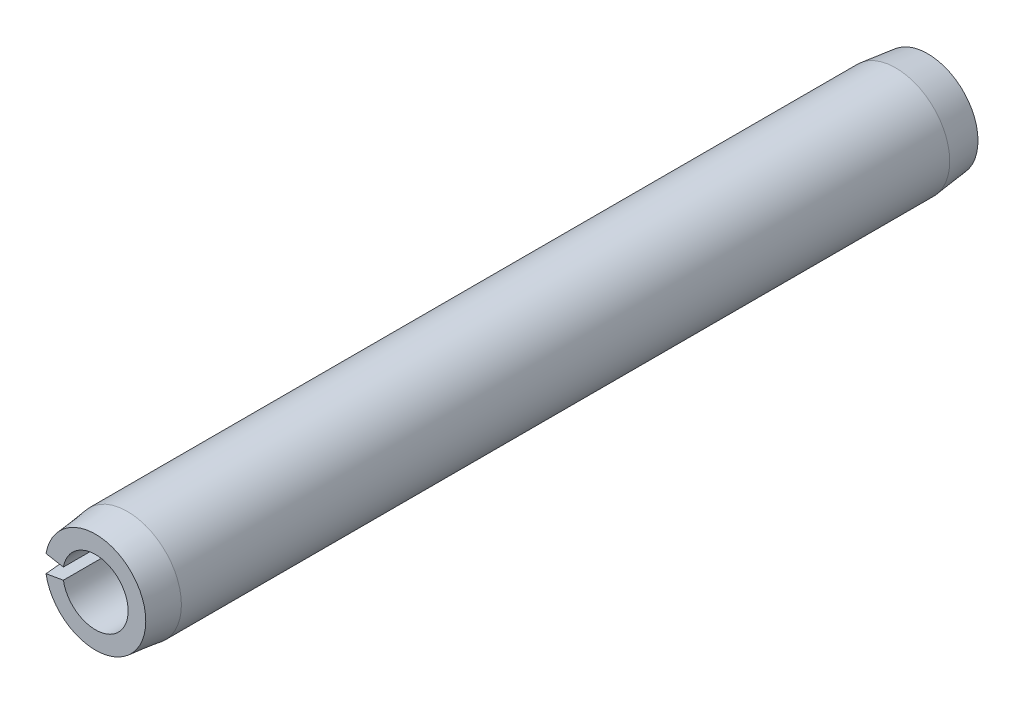
ISO-10303-21;
HEADER;
FILE_DESCRIPTION(('STEP AP214'),'2;1');
FILE_NAME('part.step','',(''),(''),'','','');
FILE_SCHEMA(('AUTOMOTIVE_DESIGN { 1 0 10303 214 1 1 1 1 }'));
ENDSEC;
DATA;
#1=APPLICATION_CONTEXT('core data for automotive mechanical design processes');
#2=APPLICATION_PROTOCOL_DEFINITION('international standard','automotive_design',2000,#1);
#3=PRODUCT_CONTEXT('',#1,'mechanical');
#4=PRODUCT('Part','Part','',(#3));
#5=PRODUCT_RELATED_PRODUCT_CATEGORY('part','',(#4));
#6=PRODUCT_DEFINITION_FORMATION('','',#4);
#7=PRODUCT_DEFINITION_CONTEXT('part definition',#1,'design');
#8=PRODUCT_DEFINITION('design','',#6,#7);
#9=PRODUCT_DEFINITION_SHAPE('','',#8);
#10=(LENGTH_UNIT() NAMED_UNIT(*) SI_UNIT(.MILLI.,.METRE.));
#11=(NAMED_UNIT(*) PLANE_ANGLE_UNIT() SI_UNIT($,.RADIAN.));
#12=(NAMED_UNIT(*) SI_UNIT($,.STERADIAN.) SOLID_ANGLE_UNIT());
#13=UNCERTAINTY_MEASURE_WITH_UNIT(LENGTH_MEASURE(1.E-05),#10,'distance_accuracy_value','');
#14=(GEOMETRIC_REPRESENTATION_CONTEXT(3) GLOBAL_UNCERTAINTY_ASSIGNED_CONTEXT((#13)) GLOBAL_UNIT_ASSIGNED_CONTEXT((#10,
#11,#12)) REPRESENTATION_CONTEXT('',''));
#15=CARTESIAN_POINT('',(0.,0.,0.));
#16=DIRECTION('',(0.,0.,1.));
#17=DIRECTION('',(1.,0.,0.));
#18=AXIS2_PLACEMENT_3D('',#15,#16,#17);
#19=CARTESIAN_POINT('',(0.,0.,15.875));
#20=DIRECTION('',(0.,0.,-1.));
#21=DIRECTION('',(-1.,0.,0.));
#22=AXIS2_PLACEMENT_3D('',#19,#20,#21);
#23=CYLINDRICAL_SURFACE('',#22,1.2446);
#24=CARTESIAN_POINT('',(0.,0.,-15.875));
#25=DIRECTION('',(0.,0.,-1.));
#26=DIRECTION('',(1.,0.,0.));
#27=AXIS2_PLACEMENT_3D('',#24,#25,#26);
#28=CIRCLE('',#27,1.2446);
#29=CARTESIAN_POINT('',(-1.22569172939899,0.216122521924258,-15.875));
#30=VERTEX_POINT('',#29);
#31=CARTESIAN_POINT('',(-1.22569172939899,-0.216122521924258,-15.875));
#32=VERTEX_POINT('',#31);
#33=EDGE_CURVE('E115',#30,#32,#28,.T.);
#34=ORIENTED_EDGE('',*,*,#33,.T.);
#35=DIRECTION('',(0.,0.,-1.));
#36=VECTOR('',#35,1.);
#37=CARTESIAN_POINT('',(-1.22569172939899,-0.216122521924258,15.875));
#38=LINE('',#37,#36);
#39=CARTESIAN_POINT('',(-1.22569172939899,-0.216122521924258,15.875));
#40=VERTEX_POINT('',#39);
#41=EDGE_CURVE('E11',#40,#32,#38,.T.);
#42=ORIENTED_EDGE('',*,*,#41,.F.);
#43=CARTESIAN_POINT('',(0.,0.,15.875));
#44=DIRECTION('',(0.,0.,-1.));
#45=DIRECTION('',(1.,0.,0.));
#46=AXIS2_PLACEMENT_3D('',#43,#44,#45);
#47=CIRCLE('',#46,1.2446);
#48=CARTESIAN_POINT('',(-1.22569172939899,0.216122521924258,15.875));
#49=VERTEX_POINT('',#48);
#50=EDGE_CURVE('E111',#49,#40,#47,.T.);
#51=ORIENTED_EDGE('',*,*,#50,.F.);
#52=DIRECTION('',(0.,0.,-1.));
#53=VECTOR('',#52,1.);
#54=CARTESIAN_POINT('',(-1.22569172939899,0.216122521924258,15.875));
#55=LINE('',#54,#53);
#56=EDGE_CURVE('E104',#49,#30,#55,.T.);
#57=ORIENTED_EDGE('',*,*,#56,.T.);
#58=EDGE_LOOP('',(#34,#42,#51,#57));
#59=FACE_BOUND('',#58,.T.);
#60=ADVANCED_FACE('F32',(#59),#23,.F.);
#61=CARTESIAN_POINT('',(-1.22569172939899,-0.216122521924258,15.875));
#62=DIRECTION('',(0.173648177666927,-0.984807753012209,0.));
#63=DIRECTION('',(0.984807753012209,0.173648177666927,0.));
#64=AXIS2_PLACEMENT_3D('',#61,#62,#63);
#65=PLANE('',#64);
#66=DIRECTION('',(0.,0.,-1.));
#67=VECTOR('',#66,1.);
#68=CARTESIAN_POINT('',(-2.02614347104732,-0.357263760731936,15.875));
#69=LINE('',#68,#67);
#70=CARTESIAN_POINT('',(-2.02614347104732,-0.357263760731937,14.6558));
#71=VERTEX_POINT('',#70);
#72=CARTESIAN_POINT('',(-2.02614347104732,-0.357263760731937,-14.6558));
#73=VERTEX_POINT('',#72);
#74=EDGE_CURVE('E39',#71,#73,#69,.T.);
#75=ORIENTED_EDGE('',*,*,#74,.F.);
#76=DIRECTION('',(-0.112108996385354,-0.0197678408428854,-0.993499272973));
#77=VECTOR('',#76,1.);
#78=CARTESIAN_POINT('',(0.,0.,32.6112909090907));
#79=LINE('',#78,#77);
#80=CARTESIAN_POINT('',(-1.88856582795152,-0.333005110311867,15.875));
#81=VERTEX_POINT('',#80);
#82=EDGE_CURVE('E86',#71,#81,#79,.F.);
#83=ORIENTED_EDGE('',*,*,#82,.T.);
#84=DIRECTION('',(-0.984807753012208,-0.173648177666927,0.));
#85=VECTOR('',#84,1.);
#86=CARTESIAN_POINT('',(-1.22569172939899,-0.216122521924258,15.875));
#87=LINE('',#86,#85);
#88=EDGE_CURVE('E119',#40,#81,#87,.T.);
#89=ORIENTED_EDGE('',*,*,#88,.F.);
#90=ORIENTED_EDGE('',*,*,#41,.T.);
#91=DIRECTION('',(-0.984807753012208,-0.173648177666927,0.));
#92=VECTOR('',#91,1.);
#93=CARTESIAN_POINT('',(-1.22569172939899,-0.216122521924258,-15.875));
#94=LINE('',#93,#92);
#95=CARTESIAN_POINT('',(-1.88856582795152,-0.333005110311867,-15.875));
#96=VERTEX_POINT('',#95);
#97=EDGE_CURVE('E112',#32,#96,#94,.T.);
#98=ORIENTED_EDGE('',*,*,#97,.T.);
#99=DIRECTION('',(0.112108996385354,0.0197678408428854,-0.993499272973));
#100=VECTOR('',#99,1.);
#101=CARTESIAN_POINT('',(0.,0.,-32.6112909090907));
#102=LINE('',#101,#100);
#103=EDGE_CURVE('E54',#96,#73,#102,.F.);
#104=ORIENTED_EDGE('',*,*,#103,.T.);
#105=EDGE_LOOP('',(#75,#83,#89,#90,#98,#104));
#106=FACE_BOUND('',#105,.T.);
#107=ADVANCED_FACE('F133',(#106),#65,.F.);
#108=CARTESIAN_POINT('',(0.,0.,15.875));
#109=DIRECTION('',(0.,0.,-1.));
#110=DIRECTION('',(-1.,0.,0.));
#111=AXIS2_PLACEMENT_3D('',#108,#109,#110);
#112=CYLINDRICAL_SURFACE('',#111,2.0574);
#113=DIRECTION('',(0.,0.,-1.));
#114=VECTOR('',#113,1.);
#115=CARTESIAN_POINT('',(-2.02614347104732,0.357263760731936,15.875));
#116=LINE('',#115,#114);
#117=CARTESIAN_POINT('',(-2.02614347104732,0.357263760731937,14.6558));
#118=VERTEX_POINT('',#117);
#119=CARTESIAN_POINT('',(-2.02614347104732,0.357263760731937,-14.6558));
#120=VERTEX_POINT('',#119);
#121=EDGE_CURVE('E96',#118,#120,#116,.T.);
#122=ORIENTED_EDGE('',*,*,#121,.F.);
#123=CARTESIAN_POINT('',(0.,0.,14.6558));
#124=DIRECTION('',(0.,0.,-1.));
#125=DIRECTION('',(-1.,0.,0.));
#126=AXIS2_PLACEMENT_3D('',#123,#124,#125);
#127=CIRCLE('',#126,2.05740000000001);
#128=EDGE_CURVE('E83',#118,#71,#127,.T.);
#129=ORIENTED_EDGE('',*,*,#128,.T.);
#130=ORIENTED_EDGE('',*,*,#74,.T.);
#131=CARTESIAN_POINT('',(0.,0.,-14.6558));
#132=DIRECTION('',(0.,0.,-1.));
#133=DIRECTION('',(-1.,0.,0.));
#134=AXIS2_PLACEMENT_3D('',#131,#132,#133);
#135=CIRCLE('',#134,2.05740000000001);
#136=EDGE_CURVE('E103',#120,#73,#135,.T.);
#137=ORIENTED_EDGE('',*,*,#136,.F.);
#138=EDGE_LOOP('',(#122,#129,#130,#137));
#139=FACE_BOUND('',#138,.T.);
#140=ADVANCED_FACE('F102',(#139),#112,.T.);
#141=CARTESIAN_POINT('',(-2.02614347104732,0.357263760731936,15.875));
#142=DIRECTION('',(0.173648177666927,0.984807753012209,0.));
#143=DIRECTION('',(-0.984807753012209,0.173648177666927,0.));
#144=AXIS2_PLACEMENT_3D('',#141,#142,#143);
#145=PLANE('',#144);
#146=DIRECTION('',(0.984807753012208,-0.173648177666927,0.));
#147=VECTOR('',#146,1.);
#148=CARTESIAN_POINT('',(-2.02614347104732,0.357263760731936,15.875));
#149=LINE('',#148,#147);
#150=CARTESIAN_POINT('',(-1.88856582795151,0.333005110311867,15.875));
#151=VERTEX_POINT('',#150);
#152=EDGE_CURVE('E99',#151,#49,#149,.T.);
#153=ORIENTED_EDGE('',*,*,#152,.F.);
#154=DIRECTION('',(0.112108996385354,-0.0197678408428854,0.993499272973));
#155=VECTOR('',#154,1.);
#156=CARTESIAN_POINT('',(0.,0.,32.6112909090907));
#157=LINE('',#156,#155);
#158=EDGE_CURVE('E46',#151,#118,#157,.F.);
#159=ORIENTED_EDGE('',*,*,#158,.T.);
#160=ORIENTED_EDGE('',*,*,#121,.T.);
#161=DIRECTION('',(-0.112108996385354,0.0197678408428854,0.993499272973));
#162=VECTOR('',#161,1.);
#163=CARTESIAN_POINT('',(0.,0.,-32.6112909090907));
#164=LINE('',#163,#162);
#165=CARTESIAN_POINT('',(-1.88856582795152,0.333005110311867,-15.875));
#166=VERTEX_POINT('',#165);
#167=EDGE_CURVE('E125',#120,#166,#164,.F.);
#168=ORIENTED_EDGE('',*,*,#167,.T.);
#169=DIRECTION('',(0.984807753012208,-0.173648177666927,0.));
#170=VECTOR('',#169,1.);
#171=CARTESIAN_POINT('',(-2.02614347104732,0.357263760731936,-15.875));
#172=LINE('',#171,#170);
#173=EDGE_CURVE('E109',#166,#30,#172,.T.);
#174=ORIENTED_EDGE('',*,*,#173,.T.);
#175=ORIENTED_EDGE('',*,*,#56,.F.);
#176=EDGE_LOOP('',(#153,#159,#160,#168,#174,#175));
#177=FACE_BOUND('',#176,.T.);
#178=ADVANCED_FACE('F94',(#177),#145,.F.);
#179=CARTESIAN_POINT('',(0.,0.,15.875));
#180=DIRECTION('',(0.,0.,1.));
#181=DIRECTION('',(1.,0.,0.));
#182=AXIS2_PLACEMENT_3D('',#179,#180,#181);
#183=PLANE('',#182);
#184=CARTESIAN_POINT('',(0.,0.,15.875));
#185=DIRECTION('',(0.,0.,-1.));
#186=DIRECTION('',(-1.,0.,0.));
#187=AXIS2_PLACEMENT_3D('',#184,#185,#186);
#188=CIRCLE('',#187,1.9177);
#189=EDGE_CURVE('E90',#151,#81,#188,.T.);
#190=ORIENTED_EDGE('',*,*,#189,.F.);
#191=ORIENTED_EDGE('',*,*,#152,.T.);
#192=ORIENTED_EDGE('',*,*,#50,.T.);
#193=ORIENTED_EDGE('',*,*,#88,.T.);
#194=EDGE_LOOP('',(#190,#191,#192,#193));
#195=FACE_BOUND('',#194,.T.);
#196=ADVANCED_FACE('F134',(#195),#183,.T.);
#197=CARTESIAN_POINT('',(0.,0.,-15.875));
#198=DIRECTION('',(0.,0.,1.));
#199=DIRECTION('',(1.,0.,0.));
#200=AXIS2_PLACEMENT_3D('',#197,#198,#199);
#201=PLANE('',#200);
#202=ORIENTED_EDGE('',*,*,#173,.F.);
#203=CARTESIAN_POINT('',(0.,0.,-15.875));
#204=DIRECTION('',(0.,0.,-1.));
#205=DIRECTION('',(-1.,0.,0.));
#206=AXIS2_PLACEMENT_3D('',#203,#204,#205);
#207=CIRCLE('',#206,1.9177);
#208=EDGE_CURVE('E127',#166,#96,#207,.T.);
#209=ORIENTED_EDGE('',*,*,#208,.T.);
#210=ORIENTED_EDGE('',*,*,#97,.F.);
#211=ORIENTED_EDGE('',*,*,#33,.F.);
#212=EDGE_LOOP('',(#202,#209,#210,#211));
#213=FACE_BOUND('',#212,.T.);
#214=ADVANCED_FACE('F141',(#213),#201,.F.);
#215=CARTESIAN_POINT('',(0.,0.,-14.6558));
#216=DIRECTION('',(0.,0.,1.));
#217=DIRECTION('',(1.,0.,0.));
#218=AXIS2_PLACEMENT_3D('',#215,#216,#217);
#219=CONICAL_SURFACE('',#218,2.05740000000001,0.114085779168161);
#220=ORIENTED_EDGE('',*,*,#208,.F.);
#221=ORIENTED_EDGE('',*,*,#167,.F.);
#222=ORIENTED_EDGE('',*,*,#136,.T.);
#223=ORIENTED_EDGE('',*,*,#103,.F.);
#224=EDGE_LOOP('',(#220,#221,#222,#223));
#225=FACE_BOUND('',#224,.T.);
#226=ADVANCED_FACE('F142',(#225),#219,.T.);
#227=CARTESIAN_POINT('',(0.,0.,15.875));
#228=DIRECTION('',(0.,0.,-1.));
#229=DIRECTION('',(-1.,0.,0.));
#230=AXIS2_PLACEMENT_3D('',#227,#228,#229);
#231=CONICAL_SURFACE('',#230,1.9177,0.114085779168161);
#232=ORIENTED_EDGE('',*,*,#128,.F.);
#233=ORIENTED_EDGE('',*,*,#158,.F.);
#234=ORIENTED_EDGE('',*,*,#189,.T.);
#235=ORIENTED_EDGE('',*,*,#82,.F.);
#236=EDGE_LOOP('',(#232,#233,#234,#235));
#237=FACE_BOUND('',#236,.T.);
#238=ADVANCED_FACE('F84',(#237),#231,.T.);
#239=CLOSED_SHELL('',(#60,#107,#140,#178,#196,#214,#226,#238));
#240=MANIFOLD_SOLID_BREP('B2',#239);
#241=ADVANCED_BREP_SHAPE_REPRESENTATION('',(#18,#240),#14);
#242=SHAPE_DEFINITION_REPRESENTATION(#9,#241);
ENDSEC;
END-ISO-10303-21;
